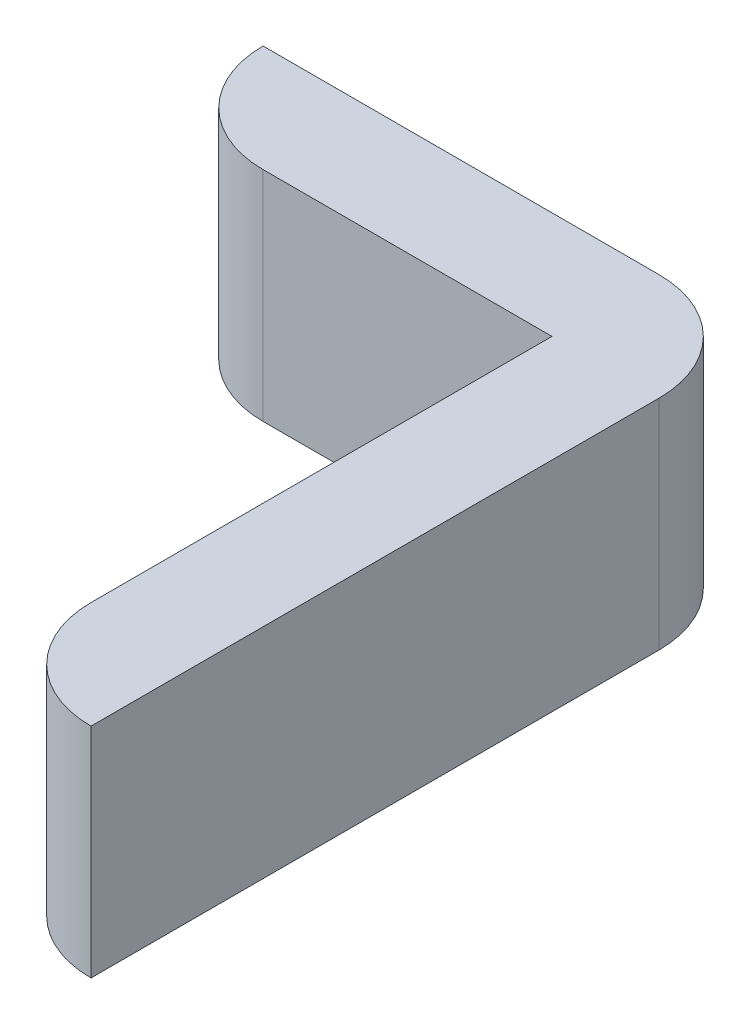
ISO-10303-21;
HEADER;
FILE_DESCRIPTION(('STEP AP214'),'2;1');
FILE_NAME('part.step','',(''),(''),'','','');
FILE_SCHEMA(('AUTOMOTIVE_DESIGN { 1 0 10303 214 1 1 1 1 }'));
ENDSEC;
DATA;
#1=APPLICATION_CONTEXT('core data for automotive mechanical design processes');
#2=APPLICATION_PROTOCOL_DEFINITION('international standard','automotive_design',2000,#1);
#3=PRODUCT_CONTEXT('',#1,'mechanical');
#4=PRODUCT('Part','Part','',(#3));
#5=PRODUCT_RELATED_PRODUCT_CATEGORY('part','',(#4));
#6=PRODUCT_DEFINITION_FORMATION('','',#4);
#7=PRODUCT_DEFINITION_CONTEXT('part definition',#1,'design');
#8=PRODUCT_DEFINITION('design','',#6,#7);
#9=PRODUCT_DEFINITION_SHAPE('','',#8);
#10=(LENGTH_UNIT() NAMED_UNIT(*) SI_UNIT(.MILLI.,.METRE.));
#11=(NAMED_UNIT(*) PLANE_ANGLE_UNIT() SI_UNIT($,.RADIAN.));
#12=(NAMED_UNIT(*) SI_UNIT($,.STERADIAN.) SOLID_ANGLE_UNIT());
#13=UNCERTAINTY_MEASURE_WITH_UNIT(LENGTH_MEASURE(1.E-05),#10,'distance_accuracy_value','');
#14=(GEOMETRIC_REPRESENTATION_CONTEXT(3) GLOBAL_UNCERTAINTY_ASSIGNED_CONTEXT((#13)) GLOBAL_UNIT_ASSIGNED_CONTEXT((#10,
#11,#12)) REPRESENTATION_CONTEXT('',''));
#15=CARTESIAN_POINT('',(0.,0.,0.));
#16=DIRECTION('',(0.,0.,1.));
#17=DIRECTION('',(1.,0.,0.));
#18=AXIS2_PLACEMENT_3D('',#15,#16,#17);
#19=CARTESIAN_POINT('',(9.275,4.0648,0.));
#20=DIRECTION('',(0.,-1.,0.));
#21=DIRECTION('',(0.,0.,-1.));
#22=AXIS2_PLACEMENT_3D('',#19,#20,#21);
#23=PLANE('',#22);
#24=DIRECTION('',(-1.,0.,0.));
#25=VECTOR('',#24,1.);
#26=CARTESIAN_POINT('',(9.525,4.0648,0.25));
#27=LINE('',#26,#25);
#28=CARTESIAN_POINT('',(9.525,4.0648,0.25));
#29=VERTEX_POINT('',#28);
#30=CARTESIAN_POINT('',(10.2,4.0648,0.25));
#31=VERTEX_POINT('',#30);
#32=EDGE_CURVE('E102',#29,#31,#27,.F.);
#33=ORIENTED_EDGE('',*,*,#32,.T.);
#34=DIRECTION('',(0.,0.,-1.));
#35=VECTOR('',#34,1.);
#36=CARTESIAN_POINT('',(10.2,4.0648,0.25));
#37=LINE('',#36,#35);
#38=CARTESIAN_POINT('',(10.2,4.0648,1.327));
#39=VERTEX_POINT('',#38);
#40=EDGE_CURVE('E108',#31,#39,#37,.F.);
#41=ORIENTED_EDGE('',*,*,#40,.T.);
#42=CARTESIAN_POINT('',(10.45,4.0648,1.327));
#43=DIRECTION('',(0.,-1.,0.));
#44=DIRECTION('',(0.,0.,-1.));
#45=AXIS2_PLACEMENT_3D('',#42,#43,#44);
#46=CIRCLE('',#45,0.25);
#47=CARTESIAN_POINT('',(10.45,4.0648,1.577));
#48=VERTEX_POINT('',#47);
#49=EDGE_CURVE('E80',#48,#39,#46,.T.);
#50=ORIENTED_EDGE('',*,*,#49,.F.);
#51=DIRECTION('',(0.,0.,1.));
#52=VECTOR('',#51,1.);
#53=CARTESIAN_POINT('',(10.45,4.0648,1.577));
#54=LINE('',#53,#52);
#55=CARTESIAN_POINT('',(10.45,4.0648,0.25));
#56=VERTEX_POINT('',#55);
#57=EDGE_CURVE('E75',#48,#56,#54,.F.);
#58=ORIENTED_EDGE('',*,*,#57,.T.);
#59=CARTESIAN_POINT('',(10.2,4.0648,0.25));
#60=DIRECTION('',(0.,-1.,0.));
#61=DIRECTION('',(0.,0.,-1.));
#62=AXIS2_PLACEMENT_3D('',#59,#60,#61);
#63=CIRCLE('',#62,0.25);
#64=CARTESIAN_POINT('',(10.2,4.0648,0.));
#65=VERTEX_POINT('',#64);
#66=EDGE_CURVE('E19',#65,#56,#63,.T.);
#67=ORIENTED_EDGE('',*,*,#66,.F.);
#68=DIRECTION('',(1.,0.,0.));
#69=VECTOR('',#68,1.);
#70=CARTESIAN_POINT('',(10.2,4.0648,0.));
#71=LINE('',#70,#69);
#72=CARTESIAN_POINT('',(9.275,4.0648,0.));
#73=VERTEX_POINT('',#72);
#74=EDGE_CURVE('E70',#65,#73,#71,.F.);
#75=ORIENTED_EDGE('',*,*,#74,.T.);
#76=CARTESIAN_POINT('',(9.525,4.0648,0.));
#77=DIRECTION('',(0.,-1.,0.));
#78=DIRECTION('',(0.,0.,-1.));
#79=AXIS2_PLACEMENT_3D('',#76,#77,#78);
#80=CIRCLE('',#79,0.25);
#81=EDGE_CURVE('E121',#29,#73,#80,.T.);
#82=ORIENTED_EDGE('',*,*,#81,.F.);
#83=EDGE_LOOP('',(#33,#41,#50,#58,#67,#75,#82));
#84=FACE_BOUND('',#83,.T.);
#85=ADVANCED_FACE('F16',(#84),#23,.F.);
#86=CARTESIAN_POINT('',(10.2,3.5552,0.));
#87=DIRECTION('',(0.,0.,1.));
#88=DIRECTION('',(1.,0.,0.));
#89=AXIS2_PLACEMENT_3D('',#86,#87,#88);
#90=PLANE('',#89);
#91=DIRECTION('',(0.,-1.,0.));
#92=VECTOR('',#91,1.);
#93=CARTESIAN_POINT('',(9.275,3.5552,0.));
#94=LINE('',#93,#92);
#95=CARTESIAN_POINT('',(9.275,3.5552,0.));
#96=VERTEX_POINT('',#95);
#97=EDGE_CURVE('E123',#73,#96,#94,.T.);
#98=ORIENTED_EDGE('',*,*,#97,.F.);
#99=ORIENTED_EDGE('',*,*,#74,.F.);
#100=DIRECTION('',(0.,-1.,0.));
#101=VECTOR('',#100,1.);
#102=CARTESIAN_POINT('',(10.2,3.5552,0.));
#103=LINE('',#102,#101);
#104=CARTESIAN_POINT('',(10.2,3.5552,0.));
#105=VERTEX_POINT('',#104);
#106=EDGE_CURVE('E92',#105,#65,#103,.F.);
#107=ORIENTED_EDGE('',*,*,#106,.F.);
#108=DIRECTION('',(1.,0.,0.));
#109=VECTOR('',#108,1.);
#110=CARTESIAN_POINT('',(9.275,3.5552,0.));
#111=LINE('',#110,#109);
#112=EDGE_CURVE('E120',#96,#105,#111,.T.);
#113=ORIENTED_EDGE('',*,*,#112,.F.);
#114=EDGE_LOOP('',(#98,#99,#107,#113));
#115=FACE_BOUND('',#114,.T.);
#116=ADVANCED_FACE('F158',(#115),#90,.F.);
#117=CARTESIAN_POINT('',(10.2,3.5552,0.25));
#118=DIRECTION('',(0.,-1.,0.));
#119=DIRECTION('',(0.,0.,-1.));
#120=AXIS2_PLACEMENT_3D('',#117,#118,#119);
#121=CYLINDRICAL_SURFACE('',#120,0.25);
#122=ORIENTED_EDGE('',*,*,#66,.T.);
#123=DIRECTION('',(0.,1.,0.));
#124=VECTOR('',#123,1.);
#125=CARTESIAN_POINT('',(10.45,3.5552,0.25));
#126=LINE('',#125,#124);
#127=CARTESIAN_POINT('',(10.45,3.5552,0.25));
#128=VERTEX_POINT('',#127);
#129=EDGE_CURVE('E86',#56,#128,#126,.F.);
#130=ORIENTED_EDGE('',*,*,#129,.T.);
#131=CARTESIAN_POINT('',(10.2,3.5552,0.25));
#132=DIRECTION('',(0.,-1.,0.));
#133=DIRECTION('',(0.,0.,-1.));
#134=AXIS2_PLACEMENT_3D('',#131,#132,#133);
#135=CIRCLE('',#134,0.25);
#136=EDGE_CURVE('E118',#105,#128,#135,.T.);
#137=ORIENTED_EDGE('',*,*,#136,.F.);
#138=ORIENTED_EDGE('',*,*,#106,.T.);
#139=EDGE_LOOP('',(#122,#130,#137,#138));
#140=FACE_BOUND('',#139,.T.);
#141=ADVANCED_FACE('F89',(#140),#121,.T.);
#142=CARTESIAN_POINT('',(10.45,3.5552,1.577));
#143=DIRECTION('',(-1.,0.,0.));
#144=DIRECTION('',(0.,0.,1.));
#145=AXIS2_PLACEMENT_3D('',#142,#143,#144);
#146=PLANE('',#145);
#147=DIRECTION('',(0.,-1.,0.));
#148=VECTOR('',#147,1.);
#149=CARTESIAN_POINT('',(10.45,3.5552,1.577));
#150=LINE('',#149,#148);
#151=CARTESIAN_POINT('',(10.45,3.5552,1.577));
#152=VERTEX_POINT('',#151);
#153=EDGE_CURVE('E85',#152,#48,#150,.F.);
#154=ORIENTED_EDGE('',*,*,#153,.F.);
#155=DIRECTION('',(0.,0.,-1.));
#156=VECTOR('',#155,1.);
#157=CARTESIAN_POINT('',(10.45,3.5552,0.));
#158=LINE('',#157,#156);
#159=EDGE_CURVE('E94',#128,#152,#158,.F.);
#160=ORIENTED_EDGE('',*,*,#159,.F.);
#161=ORIENTED_EDGE('',*,*,#129,.F.);
#162=ORIENTED_EDGE('',*,*,#57,.F.);
#163=EDGE_LOOP('',(#154,#160,#161,#162));
#164=FACE_BOUND('',#163,.T.);
#165=ADVANCED_FACE('F93',(#164),#146,.F.);
#166=CARTESIAN_POINT('',(10.45,3.5552,1.327));
#167=DIRECTION('',(0.,-1.,0.));
#168=DIRECTION('',(0.,0.,-1.));
#169=AXIS2_PLACEMENT_3D('',#166,#167,#168);
#170=CYLINDRICAL_SURFACE('',#169,0.25);
#171=ORIENTED_EDGE('',*,*,#49,.T.);
#172=DIRECTION('',(0.,1.,0.));
#173=VECTOR('',#172,1.);
#174=CARTESIAN_POINT('',(10.2,3.5552,1.327));
#175=LINE('',#174,#173);
#176=CARTESIAN_POINT('',(10.2,3.5552,1.327));
#177=VERTEX_POINT('',#176);
#178=EDGE_CURVE('E105',#39,#177,#175,.F.);
#179=ORIENTED_EDGE('',*,*,#178,.T.);
#180=CARTESIAN_POINT('',(10.45,3.5552,1.327));
#181=DIRECTION('',(0.,-1.,0.));
#182=DIRECTION('',(0.,0.,-1.));
#183=AXIS2_PLACEMENT_3D('',#180,#181,#182);
#184=CIRCLE('',#183,0.25);
#185=EDGE_CURVE('E114',#152,#177,#184,.T.);
#186=ORIENTED_EDGE('',*,*,#185,.F.);
#187=ORIENTED_EDGE('',*,*,#153,.T.);
#188=EDGE_LOOP('',(#171,#179,#186,#187));
#189=FACE_BOUND('',#188,.T.);
#190=ADVANCED_FACE('F127',(#189),#170,.T.);
#191=CARTESIAN_POINT('',(10.2,3.5552,0.25));
#192=DIRECTION('',(1.,0.,0.));
#193=DIRECTION('',(0.,0.,-1.));
#194=AXIS2_PLACEMENT_3D('',#191,#192,#193);
#195=PLANE('',#194);
#196=ORIENTED_EDGE('',*,*,#178,.F.);
#197=ORIENTED_EDGE('',*,*,#40,.F.);
#198=DIRECTION('',(0.,1.,0.));
#199=VECTOR('',#198,1.);
#200=CARTESIAN_POINT('',(10.2,3.5552,0.25));
#201=LINE('',#200,#199);
#202=CARTESIAN_POINT('',(10.2,3.5552,0.25));
#203=VERTEX_POINT('',#202);
#204=EDGE_CURVE('E104',#31,#203,#201,.F.);
#205=ORIENTED_EDGE('',*,*,#204,.T.);
#206=DIRECTION('',(0.,0.,-1.));
#207=VECTOR('',#206,1.);
#208=CARTESIAN_POINT('',(10.2,3.5552,0.));
#209=LINE('',#208,#207);
#210=EDGE_CURVE('E117',#177,#203,#209,.T.);
#211=ORIENTED_EDGE('',*,*,#210,.F.);
#212=EDGE_LOOP('',(#196,#197,#205,#211));
#213=FACE_BOUND('',#212,.T.);
#214=ADVANCED_FACE('F150',(#213),#195,.F.);
#215=CARTESIAN_POINT('',(9.525,3.5552,0.25));
#216=DIRECTION('',(0.,0.,-1.));
#217=DIRECTION('',(-1.,0.,0.));
#218=AXIS2_PLACEMENT_3D('',#215,#216,#217);
#219=PLANE('',#218);
#220=ORIENTED_EDGE('',*,*,#204,.F.);
#221=ORIENTED_EDGE('',*,*,#32,.F.);
#222=DIRECTION('',(0.,-1.,0.));
#223=VECTOR('',#222,1.);
#224=CARTESIAN_POINT('',(9.525,3.5552,0.25));
#225=LINE('',#224,#223);
#226=CARTESIAN_POINT('',(9.525,3.5552,0.25));
#227=VERTEX_POINT('',#226);
#228=EDGE_CURVE('E34',#227,#29,#225,.F.);
#229=ORIENTED_EDGE('',*,*,#228,.F.);
#230=DIRECTION('',(1.,0.,0.));
#231=VECTOR('',#230,1.);
#232=CARTESIAN_POINT('',(9.275,3.5552,0.25));
#233=LINE('',#232,#231);
#234=EDGE_CURVE('E25',#203,#227,#233,.F.);
#235=ORIENTED_EDGE('',*,*,#234,.F.);
#236=EDGE_LOOP('',(#220,#221,#229,#235));
#237=FACE_BOUND('',#236,.T.);
#238=ADVANCED_FACE('F151',(#237),#219,.F.);
#239=CARTESIAN_POINT('',(9.525,3.5552,0.));
#240=DIRECTION('',(0.,-1.,0.));
#241=DIRECTION('',(0.,0.,-1.));
#242=AXIS2_PLACEMENT_3D('',#239,#240,#241);
#243=CYLINDRICAL_SURFACE('',#242,0.25);
#244=ORIENTED_EDGE('',*,*,#81,.T.);
#245=ORIENTED_EDGE('',*,*,#97,.T.);
#246=CARTESIAN_POINT('',(9.525,3.5552,0.));
#247=DIRECTION('',(0.,-1.,0.));
#248=DIRECTION('',(0.,0.,-1.));
#249=AXIS2_PLACEMENT_3D('',#246,#247,#248);
#250=CIRCLE('',#249,0.25);
#251=EDGE_CURVE('E11',#227,#96,#250,.T.);
#252=ORIENTED_EDGE('',*,*,#251,.F.);
#253=ORIENTED_EDGE('',*,*,#228,.T.);
#254=EDGE_LOOP('',(#244,#245,#252,#253));
#255=FACE_BOUND('',#254,.T.);
#256=ADVANCED_FACE('F156',(#255),#243,.T.);
#257=CARTESIAN_POINT('',(9.275,3.5552,0.));
#258=DIRECTION('',(0.,-1.,0.));
#259=DIRECTION('',(0.,0.,-1.));
#260=AXIS2_PLACEMENT_3D('',#257,#258,#259);
#261=PLANE('',#260);
#262=ORIENTED_EDGE('',*,*,#234,.T.);
#263=ORIENTED_EDGE('',*,*,#251,.T.);
#264=ORIENTED_EDGE('',*,*,#112,.T.);
#265=ORIENTED_EDGE('',*,*,#136,.T.);
#266=ORIENTED_EDGE('',*,*,#159,.T.);
#267=ORIENTED_EDGE('',*,*,#185,.T.);
#268=ORIENTED_EDGE('',*,*,#210,.T.);
#269=EDGE_LOOP('',(#262,#263,#264,#265,#266,#267,#268));
#270=FACE_BOUND('',#269,.T.);
#271=ADVANCED_FACE('F132',(#270),#261,.T.);
#272=CLOSED_SHELL('',(#85,#116,#141,#165,#190,#214,#238,#256,#271));
#273=MANIFOLD_SOLID_BREP('B1',#272);
#274=ADVANCED_BREP_SHAPE_REPRESENTATION('',(#18,#273),#14);
#275=SHAPE_DEFINITION_REPRESENTATION(#9,#274);
ENDSEC;
END-ISO-10303-21;
